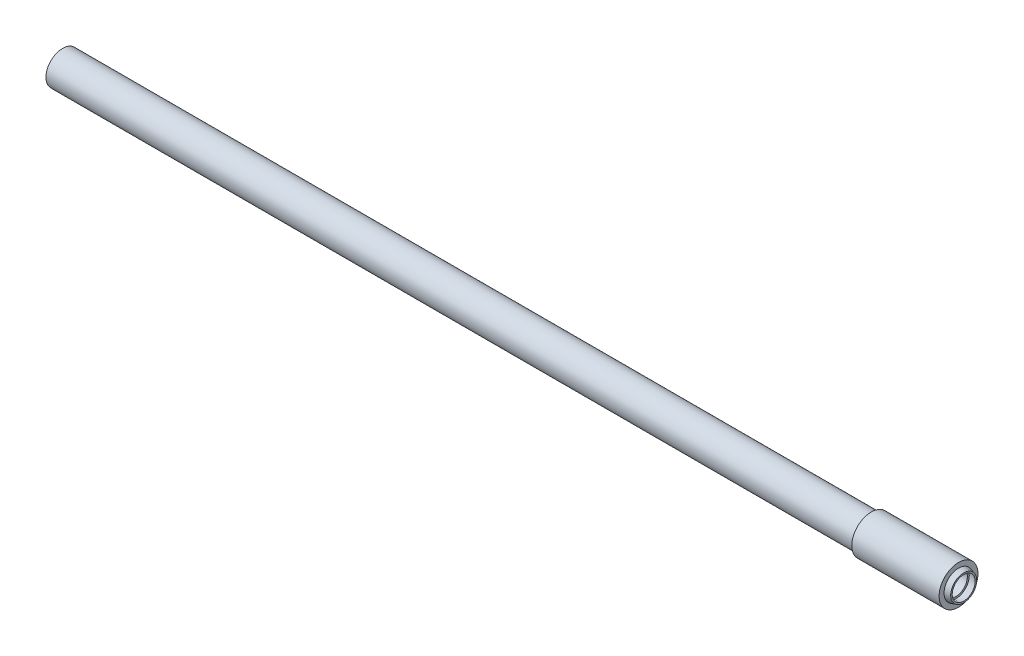
ISO-10303-21;
HEADER;
FILE_DESCRIPTION(('STEP AP214'),'2;1');
FILE_NAME('part.step','',(''),(''),'','','');
FILE_SCHEMA(('AUTOMOTIVE_DESIGN { 1 0 10303 214 1 1 1 1 }'));
ENDSEC;
DATA;
#1=APPLICATION_CONTEXT('core data for automotive mechanical design processes');
#2=APPLICATION_PROTOCOL_DEFINITION('international standard','automotive_design',2000,#1);
#3=PRODUCT_CONTEXT('',#1,'mechanical');
#4=PRODUCT('Part','Part','',(#3));
#5=PRODUCT_RELATED_PRODUCT_CATEGORY('part','',(#4));
#6=PRODUCT_DEFINITION_FORMATION('','',#4);
#7=PRODUCT_DEFINITION_CONTEXT('part definition',#1,'design');
#8=PRODUCT_DEFINITION('design','',#6,#7);
#9=PRODUCT_DEFINITION_SHAPE('','',#8);
#10=(LENGTH_UNIT() NAMED_UNIT(*) SI_UNIT(.MILLI.,.METRE.));
#11=(NAMED_UNIT(*) PLANE_ANGLE_UNIT() SI_UNIT($,.RADIAN.));
#12=(NAMED_UNIT(*) SI_UNIT($,.STERADIAN.) SOLID_ANGLE_UNIT());
#13=UNCERTAINTY_MEASURE_WITH_UNIT(LENGTH_MEASURE(1.E-05),#10,'distance_accuracy_value','');
#14=(GEOMETRIC_REPRESENTATION_CONTEXT(3) GLOBAL_UNCERTAINTY_ASSIGNED_CONTEXT((#13)) GLOBAL_UNIT_ASSIGNED_CONTEXT((#10,
#11,#12)) REPRESENTATION_CONTEXT('',''));
#15=CARTESIAN_POINT('',(0.,0.,0.));
#16=DIRECTION('',(0.,0.,1.));
#17=DIRECTION('',(1.,0.,0.));
#18=AXIS2_PLACEMENT_3D('',#15,#16,#17);
#19=CARTESIAN_POINT('',(0.,0.,-4.9784));
#20=DIRECTION('',(1.,0.,0.));
#21=DIRECTION('',(0.,0.,-1.));
#22=AXIS2_PLACEMENT_3D('',#19,#20,#21);
#23=PLANE('',#22);
#24=CARTESIAN_POINT('',(0.,0.,0.));
#25=DIRECTION('',(1.,0.,0.));
#26=DIRECTION('',(0.,0.,-1.));
#27=AXIS2_PLACEMENT_3D('',#24,#25,#26);
#28=CIRCLE('',#27,4.9784);
#29=CARTESIAN_POINT('',(0.,0.,-4.9784));
#30=VERTEX_POINT('',#29);
#31=EDGE_CURVE('E392',#30,#30,#28,.T.);
#32=ORIENTED_EDGE('',*,*,#31,.T.);
#33=EDGE_LOOP('',(#32));
#34=FACE_BOUND('',#33,.T.);
#35=CARTESIAN_POINT('',(0.,0.,0.));
#36=DIRECTION('',(1.,0.,0.));
#37=DIRECTION('',(0.,0.,-1.));
#38=AXIS2_PLACEMENT_3D('',#35,#36,#37);
#39=CIRCLE('',#38,3.7084);
#40=CARTESIAN_POINT('',(0.,0.,-3.7084));
#41=VERTEX_POINT('',#40);
#42=EDGE_CURVE('E10',#41,#41,#39,.T.);
#43=ORIENTED_EDGE('',*,*,#42,.F.);
#44=EDGE_LOOP('',(#43));
#45=FACE_BOUND('',#44,.T.);
#46=ADVANCED_FACE('F358',(#34,#45),#23,.T.);
#47=CARTESIAN_POINT('',(1.3208,0.,0.));
#48=DIRECTION('',(-1.,0.,0.));
#49=DIRECTION('',(0.,0.,1.));
#50=AXIS2_PLACEMENT_3D('',#47,#48,#49);
#51=CONICAL_SURFACE('',#50,3.3274,0.280837724621203);
#52=ORIENTED_EDGE('',*,*,#42,.T.);
#53=EDGE_LOOP('',(#52));
#54=FACE_BOUND('',#53,.T.);
#55=CARTESIAN_POINT('',(1.3208,0.,0.));
#56=DIRECTION('',(1.,0.,0.));
#57=DIRECTION('',(0.,0.,-1.));
#58=AXIS2_PLACEMENT_3D('',#55,#56,#57);
#59=CIRCLE('',#58,3.3274);
#60=CARTESIAN_POINT('',(1.3208,0.,-3.3274));
#61=VERTEX_POINT('',#60);
#62=EDGE_CURVE('E364',#61,#61,#59,.T.);
#63=ORIENTED_EDGE('',*,*,#62,.F.);
#64=EDGE_LOOP('',(#63));
#65=FACE_BOUND('',#64,.T.);
#66=ADVANCED_FACE('F410',(#54,#65),#51,.T.);
#67=CARTESIAN_POINT('',(1.3208,0.,-3.3274));
#68=DIRECTION('',(1.,0.,0.));
#69=DIRECTION('',(0.,0.,-1.));
#70=AXIS2_PLACEMENT_3D('',#67,#68,#69);
#71=PLANE('',#70);
#72=ORIENTED_EDGE('',*,*,#62,.T.);
#73=EDGE_LOOP('',(#72));
#74=FACE_BOUND('',#73,.T.);
#75=CARTESIAN_POINT('',(1.3208,0.,0.));
#76=DIRECTION('',(1.,0.,0.));
#77=DIRECTION('',(0.,0.,-1.));
#78=AXIS2_PLACEMENT_3D('',#75,#76,#77);
#79=CIRCLE('',#78,2.9464);
#80=CARTESIAN_POINT('',(1.3208,0.,-2.9464));
#81=VERTEX_POINT('',#80);
#82=EDGE_CURVE('E368',#81,#81,#79,.T.);
#83=ORIENTED_EDGE('',*,*,#82,.F.);
#84=EDGE_LOOP('',(#83));
#85=FACE_BOUND('',#84,.T.);
#86=ADVANCED_FACE('F414',(#74,#85),#71,.T.);
#87=CARTESIAN_POINT('',(-0.7112,0.,0.));
#88=DIRECTION('',(-1.,0.,0.));
#89=DIRECTION('',(0.,0.,1.));
#90=AXIS2_PLACEMENT_3D('',#87,#88,#89);
#91=CONICAL_SURFACE('',#90,3.4544,0.244978663126864);
#92=ORIENTED_EDGE('',*,*,#82,.T.);
#93=EDGE_LOOP('',(#92));
#94=FACE_BOUND('',#93,.T.);
#95=CARTESIAN_POINT('',(-0.7112,0.,0.));
#96=DIRECTION('',(1.,0.,0.));
#97=DIRECTION('',(0.,0.,-1.));
#98=AXIS2_PLACEMENT_3D('',#95,#96,#97);
#99=CIRCLE('',#98,3.4544);
#100=CARTESIAN_POINT('',(-0.7112,0.,-3.4544));
#101=VERTEX_POINT('',#100);
#102=EDGE_CURVE('E372',#101,#101,#99,.T.);
#103=ORIENTED_EDGE('',*,*,#102,.F.);
#104=EDGE_LOOP('',(#103));
#105=FACE_BOUND('',#104,.T.);
#106=ADVANCED_FACE('F418',(#94,#105),#91,.F.);
#107=CARTESIAN_POINT('',(-0.7112,0.,-3.4544));
#108=DIRECTION('',(1.,0.,0.));
#109=DIRECTION('',(0.,0.,-1.));
#110=AXIS2_PLACEMENT_3D('',#107,#108,#109);
#111=PLANE('',#110);
#112=ORIENTED_EDGE('',*,*,#102,.T.);
#113=EDGE_LOOP('',(#112));
#114=FACE_BOUND('',#113,.T.);
#115=CARTESIAN_POINT('',(-0.7112,0.,0.));
#116=DIRECTION('',(1.,0.,0.));
#117=DIRECTION('',(0.,0.,-1.));
#118=AXIS2_PLACEMENT_3D('',#115,#116,#117);
#119=CIRCLE('',#118,2.9718);
#120=CARTESIAN_POINT('',(-0.7112,0.,-2.9718));
#121=VERTEX_POINT('',#120);
#122=EDGE_CURVE('E377',#121,#121,#119,.T.);
#123=ORIENTED_EDGE('',*,*,#122,.F.);
#124=EDGE_LOOP('',(#123));
#125=FACE_BOUND('',#124,.T.);
#126=ADVANCED_FACE('F424',(#114,#125),#111,.T.);
#127=CARTESIAN_POINT('',(0.,0.,0.));
#128=DIRECTION('',(1.,0.,0.));
#129=DIRECTION('',(0.,0.,-1.));
#130=AXIS2_PLACEMENT_3D('',#127,#128,#129);
#131=CYLINDRICAL_SURFACE('',#130,2.97179999999999);
#132=ORIENTED_EDGE('',*,*,#122,.T.);
#133=EDGE_LOOP('',(#132));
#134=FACE_BOUND('',#133,.T.);
#135=CARTESIAN_POINT('',(-229.3112,0.,0.));
#136=DIRECTION('',(1.,0.,0.));
#137=DIRECTION('',(0.,0.,-1.));
#138=AXIS2_PLACEMENT_3D('',#135,#136,#137);
#139=CIRCLE('',#138,2.97179999999997);
#140=CARTESIAN_POINT('',(-229.3112,0.,-2.97179999999997));
#141=VERTEX_POINT('',#140);
#142=EDGE_CURVE('E380',#141,#141,#139,.T.);
#143=ORIENTED_EDGE('',*,*,#142,.F.);
#144=EDGE_LOOP('',(#143));
#145=FACE_BOUND('',#144,.T.);
#146=ADVANCED_FACE('F428',(#134,#145),#131,.F.);
#147=CARTESIAN_POINT('',(-229.3112,0.,-2.97179999999997));
#148=DIRECTION('',(-1.,0.,0.));
#149=DIRECTION('',(0.,0.,1.));
#150=AXIS2_PLACEMENT_3D('',#147,#148,#149);
#151=PLANE('',#150);
#152=ORIENTED_EDGE('',*,*,#142,.T.);
#153=EDGE_LOOP('',(#152));
#154=FACE_BOUND('',#153,.T.);
#155=CARTESIAN_POINT('',(-229.3112,0.,0.));
#156=DIRECTION('',(1.,0.,0.));
#157=DIRECTION('',(0.,0.,-1.));
#158=AXIS2_PLACEMENT_3D('',#155,#156,#157);
#159=CIRCLE('',#158,4.26719999999997);
#160=CARTESIAN_POINT('',(-229.3112,0.,-4.26719999999997));
#161=VERTEX_POINT('',#160);
#162=EDGE_CURVE('E383',#161,#161,#159,.T.);
#163=ORIENTED_EDGE('',*,*,#162,.F.);
#164=EDGE_LOOP('',(#163));
#165=FACE_BOUND('',#164,.T.);
#166=ADVANCED_FACE('F432',(#154,#165),#151,.T.);
#167=CARTESIAN_POINT('',(0.,0.,0.));
#168=DIRECTION('',(1.,0.,0.));
#169=DIRECTION('',(0.,0.,-1.));
#170=AXIS2_PLACEMENT_3D('',#167,#168,#169);
#171=CYLINDRICAL_SURFACE('',#170,4.26719999999999);
#172=ORIENTED_EDGE('',*,*,#162,.T.);
#173=EDGE_LOOP('',(#172));
#174=FACE_BOUND('',#173,.T.);
#175=CARTESIAN_POINT('',(-22.352,0.,0.));
#176=DIRECTION('',(1.,0.,0.));
#177=DIRECTION('',(0.,0.,-1.));
#178=AXIS2_PLACEMENT_3D('',#175,#176,#177);
#179=CIRCLE('',#178,4.2672);
#180=CARTESIAN_POINT('',(-22.352,0.,-4.2672));
#181=VERTEX_POINT('',#180);
#182=EDGE_CURVE('E386',#181,#181,#179,.T.);
#183=ORIENTED_EDGE('',*,*,#182,.F.);
#184=EDGE_LOOP('',(#183));
#185=FACE_BOUND('',#184,.T.);
#186=ADVANCED_FACE('F406',(#174,#185),#171,.T.);
#187=CARTESIAN_POINT('',(-22.352,0.,-4.9784));
#188=DIRECTION('',(-1.,0.,0.));
#189=DIRECTION('',(0.,0.,1.));
#190=AXIS2_PLACEMENT_3D('',#187,#188,#189);
#191=PLANE('',#190);
#192=ORIENTED_EDGE('',*,*,#182,.T.);
#193=EDGE_LOOP('',(#192));
#194=FACE_BOUND('',#193,.T.);
#195=CARTESIAN_POINT('',(-22.352,0.,0.));
#196=DIRECTION('',(1.,0.,0.));
#197=DIRECTION('',(0.,0.,-1.));
#198=AXIS2_PLACEMENT_3D('',#195,#196,#197);
#199=CIRCLE('',#198,4.9784);
#200=CARTESIAN_POINT('',(-22.352,0.,-4.9784));
#201=VERTEX_POINT('',#200);
#202=EDGE_CURVE('E389',#201,#201,#199,.T.);
#203=ORIENTED_EDGE('',*,*,#202,.F.);
#204=EDGE_LOOP('',(#203));
#205=FACE_BOUND('',#204,.T.);
#206=ADVANCED_FACE('F400',(#194,#205),#191,.T.);
#207=CARTESIAN_POINT('',(0.,0.,0.));
#208=DIRECTION('',(1.,0.,0.));
#209=DIRECTION('',(0.,0.,-1.));
#210=AXIS2_PLACEMENT_3D('',#207,#208,#209);
#211=CYLINDRICAL_SURFACE('',#210,4.9784);
#212=ORIENTED_EDGE('',*,*,#202,.T.);
#213=EDGE_LOOP('',(#212));
#214=FACE_BOUND('',#213,.T.);
#215=ORIENTED_EDGE('',*,*,#31,.F.);
#216=EDGE_LOOP('',(#215));
#217=FACE_BOUND('',#216,.T.);
#218=ADVANCED_FACE('F398',(#214,#217),#211,.T.);
#219=CLOSED_SHELL('',(#46,#66,#86,#106,#126,#146,#166,#186,#206,#218));
#220=MANIFOLD_SOLID_BREP('B2',#219);
#221=ADVANCED_BREP_SHAPE_REPRESENTATION('',(#18,#220),#14);
#222=SHAPE_DEFINITION_REPRESENTATION(#9,#221);
ENDSEC;
END-ISO-10303-21;
